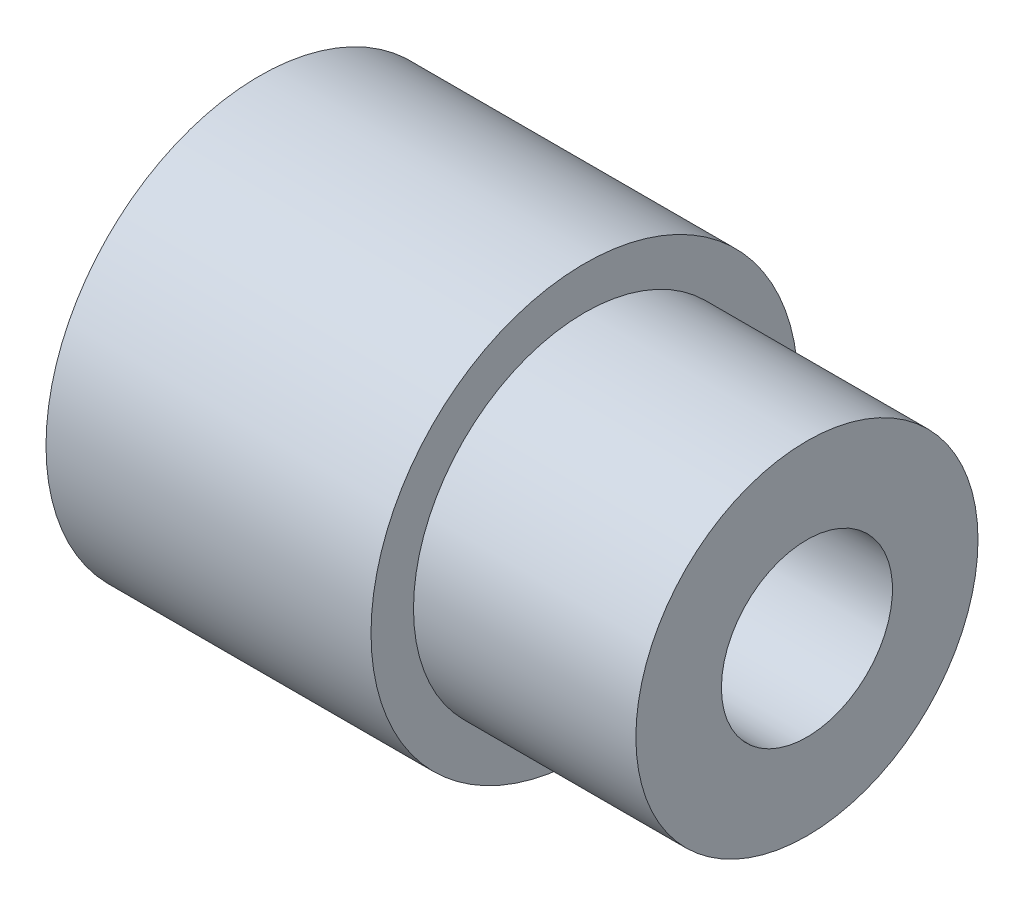
ISO-10303-21;
HEADER;
FILE_DESCRIPTION(('STEP AP214'),'2;1');
FILE_NAME('part.step','',(''),(''),'','','');
FILE_SCHEMA(('AUTOMOTIVE_DESIGN { 1 0 10303 214 1 1 1 1 }'));
ENDSEC;
DATA;
#1=APPLICATION_CONTEXT('core data for automotive mechanical design processes');
#2=APPLICATION_PROTOCOL_DEFINITION('international standard','automotive_design',2000,#1);
#3=PRODUCT_CONTEXT('',#1,'mechanical');
#4=PRODUCT('Part','Part','',(#3));
#5=PRODUCT_RELATED_PRODUCT_CATEGORY('part','',(#4));
#6=PRODUCT_DEFINITION_FORMATION('','',#4);
#7=PRODUCT_DEFINITION_CONTEXT('part definition',#1,'design');
#8=PRODUCT_DEFINITION('design','',#6,#7);
#9=PRODUCT_DEFINITION_SHAPE('','',#8);
#10=(LENGTH_UNIT() NAMED_UNIT(*) SI_UNIT(.MILLI.,.METRE.));
#11=(NAMED_UNIT(*) PLANE_ANGLE_UNIT() SI_UNIT($,.RADIAN.));
#12=(NAMED_UNIT(*) SI_UNIT($,.STERADIAN.) SOLID_ANGLE_UNIT());
#13=UNCERTAINTY_MEASURE_WITH_UNIT(LENGTH_MEASURE(1.E-05),#10,'distance_accuracy_value','');
#14=(GEOMETRIC_REPRESENTATION_CONTEXT(3) GLOBAL_UNCERTAINTY_ASSIGNED_CONTEXT((#13)) GLOBAL_UNIT_ASSIGNED_CONTEXT((#10,
#11,#12)) REPRESENTATION_CONTEXT('',''));
#15=CARTESIAN_POINT('',(0.,0.,0.));
#16=DIRECTION('',(0.,0.,1.));
#17=DIRECTION('',(1.,0.,0.));
#18=AXIS2_PLACEMENT_3D('',#15,#16,#17);
#19=CARTESIAN_POINT('',(-17.2291342965089,0.,0.));
#20=DIRECTION('',(-1.,0.,0.));
#21=DIRECTION('',(0.,0.,1.));
#22=AXIS2_PLACEMENT_3D('',#19,#20,#21);
#23=CYLINDRICAL_SURFACE('',#22,9.48367009987737);
#24=CARTESIAN_POINT('',(-26.,0.,0.));
#25=DIRECTION('',(-1.,0.,0.));
#26=DIRECTION('',(0.,0.,1.));
#27=AXIS2_PLACEMENT_3D('',#24,#25,#26);
#28=CIRCLE('',#27,9.48367009987737);
#29=CARTESIAN_POINT('',(-26.,0.,9.48367009987737));
#30=VERTEX_POINT('',#29);
#31=EDGE_CURVE('E65',#30,#30,#28,.T.);
#32=ORIENTED_EDGE('',*,*,#31,.F.);
#33=EDGE_LOOP('',(#32));
#34=FACE_BOUND('',#33,.T.);
#35=CARTESIAN_POINT('',(-32.,0.,0.));
#36=DIRECTION('',(-1.,0.,0.));
#37=DIRECTION('',(0.,0.,1.));
#38=AXIS2_PLACEMENT_3D('',#35,#36,#37);
#39=CIRCLE('',#38,9.48367009987737);
#40=CARTESIAN_POINT('',(-32.,0.,9.48367009987737));
#41=VERTEX_POINT('',#40);
#42=EDGE_CURVE('E10',#41,#41,#39,.T.);
#43=ORIENTED_EDGE('',*,*,#42,.T.);
#44=EDGE_LOOP('',(#43));
#45=FACE_BOUND('',#44,.T.);
#46=ADVANCED_FACE('F31',(#34,#45),#23,.F.);
#47=CARTESIAN_POINT('',(-32.,9.48367009987737,0.));
#48=DIRECTION('',(1.,0.,0.));
#49=DIRECTION('',(0.,0.,-1.));
#50=AXIS2_PLACEMENT_3D('',#47,#48,#49);
#51=PLANE('',#50);
#52=ORIENTED_EDGE('',*,*,#42,.F.);
#53=EDGE_LOOP('',(#52));
#54=FACE_BOUND('',#53,.T.);
#55=CARTESIAN_POINT('',(-32.,0.,0.));
#56=DIRECTION('',(-1.,0.,0.));
#57=DIRECTION('',(0.,0.,1.));
#58=AXIS2_PLACEMENT_3D('',#55,#56,#57);
#59=CIRCLE('',#58,12.4836700998774);
#60=CARTESIAN_POINT('',(-32.,0.,12.4836700998774));
#61=VERTEX_POINT('',#60);
#62=EDGE_CURVE('E37',#61,#61,#59,.T.);
#63=ORIENTED_EDGE('',*,*,#62,.T.);
#64=EDGE_LOOP('',(#63));
#65=FACE_BOUND('',#64,.T.);
#66=ADVANCED_FACE('F72',(#54,#65),#51,.F.);
#67=CARTESIAN_POINT('',(-17.2291342965089,0.,0.));
#68=DIRECTION('',(-1.,0.,0.));
#69=DIRECTION('',(0.,0.,1.));
#70=AXIS2_PLACEMENT_3D('',#67,#68,#69);
#71=CYLINDRICAL_SURFACE('',#70,12.4836700998774);
#72=ORIENTED_EDGE('',*,*,#62,.F.);
#73=EDGE_LOOP('',(#72));
#74=FACE_BOUND('',#73,.T.);
#75=CARTESIAN_POINT('',(-13.,0.,0.));
#76=DIRECTION('',(-1.,0.,0.));
#77=DIRECTION('',(0.,0.,1.));
#78=AXIS2_PLACEMENT_3D('',#75,#76,#77);
#79=CIRCLE('',#78,12.4836700998774);
#80=CARTESIAN_POINT('',(-13.,0.,12.4836700998774));
#81=VERTEX_POINT('',#80);
#82=EDGE_CURVE('E41',#81,#81,#79,.T.);
#83=ORIENTED_EDGE('',*,*,#82,.T.);
#84=EDGE_LOOP('',(#83));
#85=FACE_BOUND('',#84,.T.);
#86=ADVANCED_FACE('F76',(#74,#85),#71,.T.);
#87=CARTESIAN_POINT('',(-13.,12.4836700998774,0.));
#88=DIRECTION('',(-1.,0.,0.));
#89=DIRECTION('',(0.,0.,1.));
#90=AXIS2_PLACEMENT_3D('',#87,#88,#89);
#91=PLANE('',#90);
#92=ORIENTED_EDGE('',*,*,#82,.F.);
#93=EDGE_LOOP('',(#92));
#94=FACE_BOUND('',#93,.T.);
#95=CARTESIAN_POINT('',(-13.,0.,0.));
#96=DIRECTION('',(-1.,0.,0.));
#97=DIRECTION('',(0.,0.,1.));
#98=AXIS2_PLACEMENT_3D('',#95,#96,#97);
#99=CIRCLE('',#98,10.);
#100=CARTESIAN_POINT('',(-13.,0.,10.));
#101=VERTEX_POINT('',#100);
#102=EDGE_CURVE('E45',#101,#101,#99,.T.);
#103=ORIENTED_EDGE('',*,*,#102,.T.);
#104=EDGE_LOOP('',(#103));
#105=FACE_BOUND('',#104,.T.);
#106=ADVANCED_FACE('F81',(#94,#105),#91,.F.);
#107=CARTESIAN_POINT('',(-17.2291342965089,0.,0.));
#108=DIRECTION('',(-1.,0.,0.));
#109=DIRECTION('',(0.,0.,1.));
#110=AXIS2_PLACEMENT_3D('',#107,#108,#109);
#111=CYLINDRICAL_SURFACE('',#110,10.);
#112=ORIENTED_EDGE('',*,*,#102,.F.);
#113=EDGE_LOOP('',(#112));
#114=FACE_BOUND('',#113,.T.);
#115=CARTESIAN_POINT('',(0.,0.,0.));
#116=DIRECTION('',(-1.,0.,0.));
#117=DIRECTION('',(0.,0.,1.));
#118=AXIS2_PLACEMENT_3D('',#115,#116,#117);
#119=CIRCLE('',#118,10.);
#120=CARTESIAN_POINT('',(0.,0.,10.));
#121=VERTEX_POINT('',#120);
#122=EDGE_CURVE('E50',#121,#121,#119,.T.);
#123=ORIENTED_EDGE('',*,*,#122,.T.);
#124=EDGE_LOOP('',(#123));
#125=FACE_BOUND('',#124,.T.);
#126=ADVANCED_FACE('F87',(#114,#125),#111,.T.);
#127=CARTESIAN_POINT('',(0.,10.,0.));
#128=DIRECTION('',(-1.,0.,0.));
#129=DIRECTION('',(0.,0.,1.));
#130=AXIS2_PLACEMENT_3D('',#127,#128,#129);
#131=PLANE('',#130);
#132=ORIENTED_EDGE('',*,*,#122,.F.);
#133=EDGE_LOOP('',(#132));
#134=FACE_BOUND('',#133,.T.);
#135=CARTESIAN_POINT('',(0.,0.,0.));
#136=DIRECTION('',(-1.,0.,0.));
#137=DIRECTION('',(0.,0.,1.));
#138=AXIS2_PLACEMENT_3D('',#135,#136,#137);
#139=CIRCLE('',#138,5.);
#140=CARTESIAN_POINT('',(0.,0.,5.));
#141=VERTEX_POINT('',#140);
#142=EDGE_CURVE('E53',#141,#141,#139,.T.);
#143=ORIENTED_EDGE('',*,*,#142,.T.);
#144=EDGE_LOOP('',(#143));
#145=FACE_BOUND('',#144,.T.);
#146=ADVANCED_FACE('F91',(#134,#145),#131,.F.);
#147=CARTESIAN_POINT('',(-17.2291342965089,0.,0.));
#148=DIRECTION('',(-1.,0.,0.));
#149=DIRECTION('',(0.,0.,1.));
#150=AXIS2_PLACEMENT_3D('',#147,#148,#149);
#151=CYLINDRICAL_SURFACE('',#150,5.);
#152=ORIENTED_EDGE('',*,*,#142,.F.);
#153=EDGE_LOOP('',(#152));
#154=FACE_BOUND('',#153,.T.);
#155=CARTESIAN_POINT('',(-16.,0.,0.));
#156=DIRECTION('',(-1.,0.,0.));
#157=DIRECTION('',(0.,0.,1.));
#158=AXIS2_PLACEMENT_3D('',#155,#156,#157);
#159=CIRCLE('',#158,5.);
#160=CARTESIAN_POINT('',(-16.,0.,5.));
#161=VERTEX_POINT('',#160);
#162=EDGE_CURVE('E56',#161,#161,#159,.T.);
#163=ORIENTED_EDGE('',*,*,#162,.T.);
#164=EDGE_LOOP('',(#163));
#165=FACE_BOUND('',#164,.T.);
#166=ADVANCED_FACE('F95',(#154,#165),#151,.F.);
#167=CARTESIAN_POINT('',(-16.,7.48367009987737,0.));
#168=DIRECTION('',(1.,0.,0.));
#169=DIRECTION('',(0.,0.,-1.));
#170=AXIS2_PLACEMENT_3D('',#167,#168,#169);
#171=PLANE('',#170);
#172=ORIENTED_EDGE('',*,*,#162,.F.);
#173=EDGE_LOOP('',(#172));
#174=FACE_BOUND('',#173,.T.);
#175=CARTESIAN_POINT('',(-16.,0.,0.));
#176=DIRECTION('',(-1.,0.,0.));
#177=DIRECTION('',(0.,0.,1.));
#178=AXIS2_PLACEMENT_3D('',#175,#176,#177);
#179=CIRCLE('',#178,7.48367009987737);
#180=CARTESIAN_POINT('',(-16.,0.,7.48367009987737));
#181=VERTEX_POINT('',#180);
#182=EDGE_CURVE('E59',#181,#181,#179,.T.);
#183=ORIENTED_EDGE('',*,*,#182,.T.);
#184=EDGE_LOOP('',(#183));
#185=FACE_BOUND('',#184,.T.);
#186=ADVANCED_FACE('F99',(#174,#185),#171,.F.);
#187=CARTESIAN_POINT('',(-17.2291342965089,0.,0.));
#188=DIRECTION('',(-1.,0.,0.));
#189=DIRECTION('',(0.,0.,1.));
#190=AXIS2_PLACEMENT_3D('',#187,#188,#189);
#191=CYLINDRICAL_SURFACE('',#190,7.48367009987737);
#192=ORIENTED_EDGE('',*,*,#182,.F.);
#193=EDGE_LOOP('',(#192));
#194=FACE_BOUND('',#193,.T.);
#195=CARTESIAN_POINT('',(-26.,0.,0.));
#196=DIRECTION('',(-1.,0.,0.));
#197=DIRECTION('',(0.,0.,1.));
#198=AXIS2_PLACEMENT_3D('',#195,#196,#197);
#199=CIRCLE('',#198,7.48367009987737);
#200=CARTESIAN_POINT('',(-26.,0.,7.48367009987737));
#201=VERTEX_POINT('',#200);
#202=EDGE_CURVE('E62',#201,#201,#199,.T.);
#203=ORIENTED_EDGE('',*,*,#202,.T.);
#204=EDGE_LOOP('',(#203));
#205=FACE_BOUND('',#204,.T.);
#206=ADVANCED_FACE('F103',(#194,#205),#191,.F.);
#207=CARTESIAN_POINT('',(-26.,9.48367009987737,0.));
#208=DIRECTION('',(1.,0.,0.));
#209=DIRECTION('',(0.,0.,-1.));
#210=AXIS2_PLACEMENT_3D('',#207,#208,#209);
#211=PLANE('',#210);
#212=ORIENTED_EDGE('',*,*,#202,.F.);
#213=EDGE_LOOP('',(#212));
#214=FACE_BOUND('',#213,.T.);
#215=ORIENTED_EDGE('',*,*,#31,.T.);
#216=EDGE_LOOP('',(#215));
#217=FACE_BOUND('',#216,.T.);
#218=ADVANCED_FACE('F69',(#214,#217),#211,.F.);
#219=CLOSED_SHELL('',(#46,#66,#86,#106,#126,#146,#166,#186,#206,#218));
#220=MANIFOLD_SOLID_BREP('B2',#219);
#221=ADVANCED_BREP_SHAPE_REPRESENTATION('',(#18,#220),#14);
#222=SHAPE_DEFINITION_REPRESENTATION(#9,#221);
ENDSEC;
END-ISO-10303-21;
